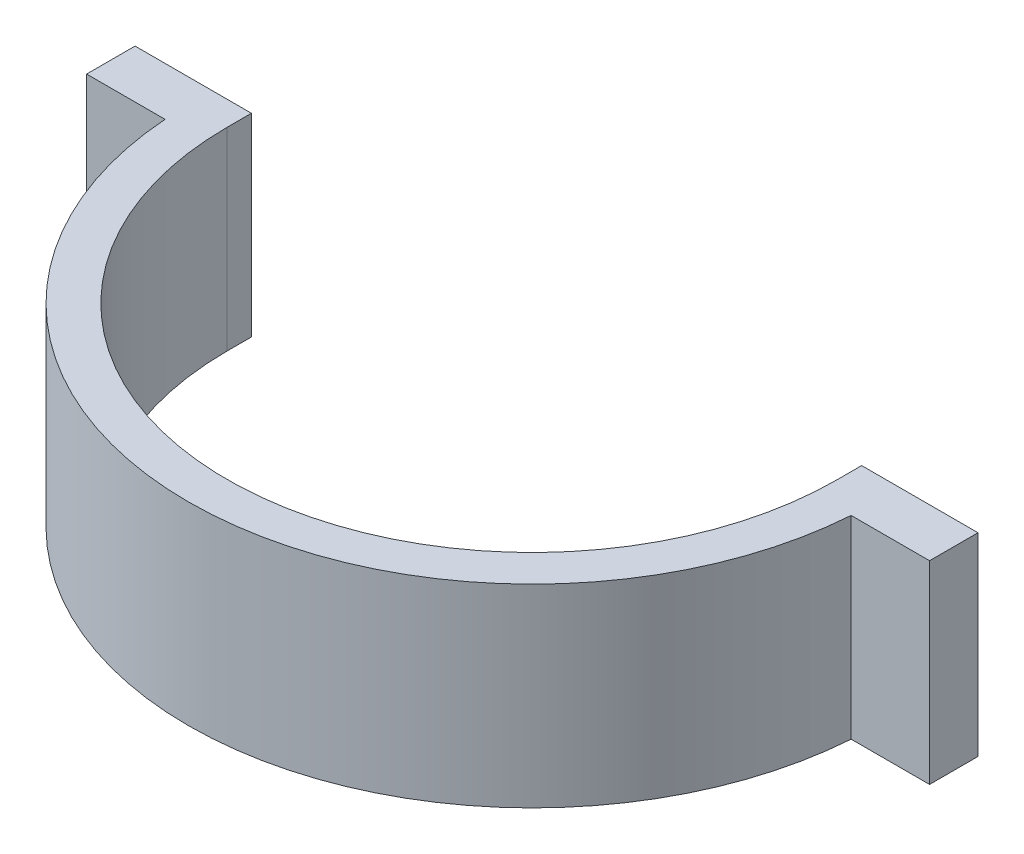
ISO-10303-21;
HEADER;
FILE_DESCRIPTION(('STEP AP214'),'2;1');
FILE_NAME('part.step','',(''),(''),'','','');
FILE_SCHEMA(('AUTOMOTIVE_DESIGN { 1 0 10303 214 1 1 1 1 }'));
ENDSEC;
DATA;
#1=APPLICATION_CONTEXT('core data for automotive mechanical design processes');
#2=APPLICATION_PROTOCOL_DEFINITION('international standard','automotive_design',2000,#1);
#3=PRODUCT_CONTEXT('',#1,'mechanical');
#4=PRODUCT('Part','Part','',(#3));
#5=PRODUCT_RELATED_PRODUCT_CATEGORY('part','',(#4));
#6=PRODUCT_DEFINITION_FORMATION('','',#4);
#7=PRODUCT_DEFINITION_CONTEXT('part definition',#1,'design');
#8=PRODUCT_DEFINITION('design','',#6,#7);
#9=PRODUCT_DEFINITION_SHAPE('','',#8);
#10=(LENGTH_UNIT() NAMED_UNIT(*) SI_UNIT(.MILLI.,.METRE.));
#11=(NAMED_UNIT(*) PLANE_ANGLE_UNIT() SI_UNIT($,.RADIAN.));
#12=(NAMED_UNIT(*) SI_UNIT($,.STERADIAN.) SOLID_ANGLE_UNIT());
#13=UNCERTAINTY_MEASURE_WITH_UNIT(LENGTH_MEASURE(1.E-05),#10,'distance_accuracy_value','');
#14=(GEOMETRIC_REPRESENTATION_CONTEXT(3) GLOBAL_UNCERTAINTY_ASSIGNED_CONTEXT((#13)) GLOBAL_UNIT_ASSIGNED_CONTEXT((#10,
#11,#12)) REPRESENTATION_CONTEXT('',''));
#15=CARTESIAN_POINT('',(0.,0.,0.));
#16=DIRECTION('',(0.,0.,1.));
#17=DIRECTION('',(1.,0.,0.));
#18=AXIS2_PLACEMENT_3D('',#15,#16,#17);
#19=CARTESIAN_POINT('',(0.,25.4,0.));
#20=DIRECTION('',(0.,-1.,0.));
#21=DIRECTION('',(0.,0.,-1.));
#22=AXIS2_PLACEMENT_3D('',#19,#20,#21);
#23=CYLINDRICAL_SURFACE('',#22,45.0723);
#24=DIRECTION('',(0.,-1.,0.));
#25=VECTOR('',#24,1.);
#26=CARTESIAN_POINT('',(-44.9603336541223,25.4,3.175));
#27=LINE('',#26,#25);
#28=CARTESIAN_POINT('',(-44.9603336541223,0.,3.175));
#29=VERTEX_POINT('',#28);
#30=CARTESIAN_POINT('',(-44.9603336541223,25.4,3.175));
#31=VERTEX_POINT('',#30);
#32=EDGE_CURVE('E137',#29,#31,#27,.F.);
#33=ORIENTED_EDGE('',*,*,#32,.F.);
#34=CARTESIAN_POINT('',(0.,0.,0.));
#35=DIRECTION('',(0.,1.,0.));
#36=DIRECTION('',(0.,0.,1.));
#37=AXIS2_PLACEMENT_3D('',#34,#35,#36);
#38=CIRCLE('',#37,45.0723);
#39=CARTESIAN_POINT('',(44.9603336541223,0.,3.175));
#40=VERTEX_POINT('',#39);
#41=EDGE_CURVE('E57',#29,#40,#38,.T.);
#42=ORIENTED_EDGE('',*,*,#41,.T.);
#43=DIRECTION('',(0.,-1.,0.));
#44=VECTOR('',#43,1.);
#45=CARTESIAN_POINT('',(44.9603336541223,25.4,3.175));
#46=LINE('',#45,#44);
#47=CARTESIAN_POINT('',(44.9603336541223,25.4,3.175));
#48=VERTEX_POINT('',#47);
#49=EDGE_CURVE('E11',#48,#40,#46,.T.);
#50=ORIENTED_EDGE('',*,*,#49,.F.);
#51=CARTESIAN_POINT('',(0.,25.4,0.));
#52=DIRECTION('',(0.,1.,0.));
#53=DIRECTION('',(0.,0.,1.));
#54=AXIS2_PLACEMENT_3D('',#51,#52,#53);
#55=CIRCLE('',#54,45.0723);
#56=EDGE_CURVE('E175',#31,#48,#55,.T.);
#57=ORIENTED_EDGE('',*,*,#56,.F.);
#58=EDGE_LOOP('',(#33,#42,#50,#57));
#59=FACE_BOUND('',#58,.T.);
#60=ADVANCED_FACE('F35',(#59),#23,.T.);
#61=CARTESIAN_POINT('',(0.,25.4,0.));
#62=DIRECTION('',(0.,1.,0.));
#63=DIRECTION('',(0.,0.,1.));
#64=AXIS2_PLACEMENT_3D('',#61,#62,#63);
#65=PLANE('',#64);
#66=DIRECTION('',(1.,0.,0.));
#67=VECTOR('',#66,1.);
#68=CARTESIAN_POINT('',(-45.0814156653053,25.4,3.175));
#69=LINE('',#68,#67);
#70=CARTESIAN_POINT('',(-55.2414156653053,25.4,3.175));
#71=VERTEX_POINT('',#70);
#72=EDGE_CURVE('E131',#71,#31,#69,.T.);
#73=ORIENTED_EDGE('',*,*,#72,.T.);
#74=ORIENTED_EDGE('',*,*,#56,.T.);
#75=DIRECTION('',(1.,0.,0.));
#76=VECTOR('',#75,1.);
#77=CARTESIAN_POINT('',(45.0814156653053,25.4,3.175));
#78=LINE('',#77,#76);
#79=CARTESIAN_POINT('',(55.2414156653053,25.4,3.175));
#80=VERTEX_POINT('',#79);
#81=EDGE_CURVE('E149',#48,#80,#78,.T.);
#82=ORIENTED_EDGE('',*,*,#81,.T.);
#83=DIRECTION('',(0.,0.,1.));
#84=VECTOR('',#83,1.);
#85=CARTESIAN_POINT('',(55.2414156653053,25.4,-3.175));
#86=LINE('',#85,#84);
#87=CARTESIAN_POINT('',(55.2414156653053,25.4,-3.175));
#88=VERTEX_POINT('',#87);
#89=EDGE_CURVE('E168',#88,#80,#86,.T.);
#90=ORIENTED_EDGE('',*,*,#89,.F.);
#91=DIRECTION('',(1.,0.,0.));
#92=VECTOR('',#91,1.);
#93=CARTESIAN_POINT('',(45.0814156653053,25.4,-3.175));
#94=LINE('',#93,#92);
#95=CARTESIAN_POINT('',(39.9923,25.4,-3.175));
#96=VERTEX_POINT('',#95);
#97=EDGE_CURVE('E145',#96,#88,#94,.T.);
#98=ORIENTED_EDGE('',*,*,#97,.F.);
#99=DIRECTION('',(0.,0.,1.));
#100=VECTOR('',#99,1.);
#101=CARTESIAN_POINT('',(39.9923,25.4,-3.175));
#102=LINE('',#101,#100);
#103=CARTESIAN_POINT('',(39.9923,25.4,0.));
#104=VERTEX_POINT('',#103);
#105=EDGE_CURVE('E49',#96,#104,#102,.T.);
#106=ORIENTED_EDGE('',*,*,#105,.T.);
#107=CARTESIAN_POINT('',(0.,25.4,0.));
#108=DIRECTION('',(0.,1.,0.));
#109=DIRECTION('',(0.,0.,1.));
#110=AXIS2_PLACEMENT_3D('',#107,#108,#109);
#111=CIRCLE('',#110,39.9923);
#112=CARTESIAN_POINT('',(-39.9923,25.4,0.));
#113=VERTEX_POINT('',#112);
#114=EDGE_CURVE('E136',#113,#104,#111,.T.);
#115=ORIENTED_EDGE('',*,*,#114,.F.);
#116=DIRECTION('',(0.,0.,1.));
#117=VECTOR('',#116,1.);
#118=CARTESIAN_POINT('',(-39.9923,25.4,-3.175));
#119=LINE('',#118,#117);
#120=CARTESIAN_POINT('',(-39.9923,25.4,-3.175));
#121=VERTEX_POINT('',#120);
#122=EDGE_CURVE('E116',#121,#113,#119,.T.);
#123=ORIENTED_EDGE('',*,*,#122,.F.);
#124=DIRECTION('',(1.,0.,0.));
#125=VECTOR('',#124,1.);
#126=CARTESIAN_POINT('',(-45.0814156653053,25.4,-3.175));
#127=LINE('',#126,#125);
#128=CARTESIAN_POINT('',(-55.2414156653053,25.4,-3.175));
#129=VERTEX_POINT('',#128);
#130=EDGE_CURVE('E123',#129,#121,#127,.T.);
#131=ORIENTED_EDGE('',*,*,#130,.F.);
#132=DIRECTION('',(0.,0.,1.));
#133=VECTOR('',#132,1.);
#134=CARTESIAN_POINT('',(-55.2414156653053,25.4,-3.175));
#135=LINE('',#134,#133);
#136=EDGE_CURVE('E209',#129,#71,#135,.T.);
#137=ORIENTED_EDGE('',*,*,#136,.T.);
#138=EDGE_LOOP('',(#73,#74,#82,#90,#98,#106,#115,#123,#131,#137));
#139=FACE_BOUND('',#138,.T.);
#140=ADVANCED_FACE('F134',(#139),#65,.T.);
#141=CARTESIAN_POINT('',(0.,0.,0.));
#142=DIRECTION('',(0.,1.,0.));
#143=DIRECTION('',(0.,0.,1.));
#144=AXIS2_PLACEMENT_3D('',#141,#142,#143);
#145=PLANE('',#144);
#146=ORIENTED_EDGE('',*,*,#41,.F.);
#147=DIRECTION('',(-1.,0.,0.));
#148=VECTOR('',#147,1.);
#149=CARTESIAN_POINT('',(-55.2414156653053,0.,3.175));
#150=LINE('',#149,#148);
#151=CARTESIAN_POINT('',(-55.2414156653053,0.,3.175));
#152=VERTEX_POINT('',#151);
#153=EDGE_CURVE('E201',#29,#152,#150,.T.);
#154=ORIENTED_EDGE('',*,*,#153,.T.);
#155=DIRECTION('',(0.,0.,1.));
#156=VECTOR('',#155,1.);
#157=CARTESIAN_POINT('',(-55.2414156653053,0.,-3.175));
#158=LINE('',#157,#156);
#159=CARTESIAN_POINT('',(-55.2414156653053,0.,-3.175));
#160=VERTEX_POINT('',#159);
#161=EDGE_CURVE('E141',#160,#152,#158,.T.);
#162=ORIENTED_EDGE('',*,*,#161,.F.);
#163=DIRECTION('',(-1.,0.,0.));
#164=VECTOR('',#163,1.);
#165=CARTESIAN_POINT('',(-45.1671960583249,0.,-3.175));
#166=LINE('',#165,#164);
#167=CARTESIAN_POINT('',(-39.9923,0.,-3.175));
#168=VERTEX_POINT('',#167);
#169=EDGE_CURVE('E122',#168,#160,#166,.T.);
#170=ORIENTED_EDGE('',*,*,#169,.F.);
#171=DIRECTION('',(0.,0.,1.));
#172=VECTOR('',#171,1.);
#173=CARTESIAN_POINT('',(-39.9923,0.,-3.175));
#174=LINE('',#173,#172);
#175=CARTESIAN_POINT('',(-39.9923,0.,0.));
#176=VERTEX_POINT('',#175);
#177=EDGE_CURVE('E119',#168,#176,#174,.T.);
#178=ORIENTED_EDGE('',*,*,#177,.T.);
#179=CARTESIAN_POINT('',(0.,0.,0.));
#180=DIRECTION('',(0.,1.,0.));
#181=DIRECTION('',(0.,0.,1.));
#182=AXIS2_PLACEMENT_3D('',#179,#180,#181);
#183=CIRCLE('',#182,39.9923);
#184=CARTESIAN_POINT('',(39.9923,0.,0.));
#185=VERTEX_POINT('',#184);
#186=EDGE_CURVE('E171',#176,#185,#183,.T.);
#187=ORIENTED_EDGE('',*,*,#186,.T.);
#188=DIRECTION('',(0.,0.,1.));
#189=VECTOR('',#188,1.);
#190=CARTESIAN_POINT('',(39.9923,0.,-3.175));
#191=LINE('',#190,#189);
#192=CARTESIAN_POINT('',(39.9923,0.,-3.175));
#193=VERTEX_POINT('',#192);
#194=EDGE_CURVE('E163',#193,#185,#191,.T.);
#195=ORIENTED_EDGE('',*,*,#194,.F.);
#196=DIRECTION('',(-1.,0.,0.));
#197=VECTOR('',#196,1.);
#198=CARTESIAN_POINT('',(55.2414156653053,0.,-3.175));
#199=LINE('',#198,#197);
#200=CARTESIAN_POINT('',(55.2414156653053,0.,-3.175));
#201=VERTEX_POINT('',#200);
#202=EDGE_CURVE('E151',#201,#193,#199,.T.);
#203=ORIENTED_EDGE('',*,*,#202,.F.);
#204=DIRECTION('',(0.,0.,1.));
#205=VECTOR('',#204,1.);
#206=CARTESIAN_POINT('',(55.2414156653053,0.,-3.175));
#207=LINE('',#206,#205);
#208=CARTESIAN_POINT('',(55.2414156653053,0.,3.175));
#209=VERTEX_POINT('',#208);
#210=EDGE_CURVE('E165',#201,#209,#207,.T.);
#211=ORIENTED_EDGE('',*,*,#210,.T.);
#212=DIRECTION('',(-1.,0.,0.));
#213=VECTOR('',#212,1.);
#214=CARTESIAN_POINT('',(45.1671960583249,0.,3.175));
#215=LINE('',#214,#213);
#216=EDGE_CURVE('E158',#209,#40,#215,.T.);
#217=ORIENTED_EDGE('',*,*,#216,.T.);
#218=EDGE_LOOP('',(#146,#154,#162,#170,#178,#187,#195,#203,#211,#217));
#219=FACE_BOUND('',#218,.T.);
#220=ADVANCED_FACE('F182',(#219),#145,.F.);
#221=CARTESIAN_POINT('',(0.,25.4,0.));
#222=DIRECTION('',(0.,-1.,0.));
#223=DIRECTION('',(0.,0.,-1.));
#224=AXIS2_PLACEMENT_3D('',#221,#222,#223);
#225=CYLINDRICAL_SURFACE('',#224,39.9923);
#226=DIRECTION('',(0.,-1.,0.));
#227=VECTOR('',#226,1.);
#228=CARTESIAN_POINT('',(-39.9923,25.4,0.));
#229=LINE('',#228,#227);
#230=EDGE_CURVE('E42',#113,#176,#229,.T.);
#231=ORIENTED_EDGE('',*,*,#230,.F.);
#232=ORIENTED_EDGE('',*,*,#114,.T.);
#233=DIRECTION('',(0.,-1.,0.));
#234=VECTOR('',#233,1.);
#235=CARTESIAN_POINT('',(39.9923,25.4,0.));
#236=LINE('',#235,#234);
#237=EDGE_CURVE('E177',#185,#104,#236,.F.);
#238=ORIENTED_EDGE('',*,*,#237,.F.);
#239=ORIENTED_EDGE('',*,*,#186,.F.);
#240=EDGE_LOOP('',(#231,#232,#238,#239));
#241=FACE_BOUND('',#240,.T.);
#242=ADVANCED_FACE('F186',(#241),#225,.F.);
#243=CARTESIAN_POINT('',(0.,0.,3.175));
#244=DIRECTION('',(0.,0.,-1.));
#245=DIRECTION('',(-1.,0.,0.));
#246=AXIS2_PLACEMENT_3D('',#243,#244,#245);
#247=PLANE('',#246);
#248=ORIENTED_EDGE('',*,*,#81,.F.);
#249=ORIENTED_EDGE('',*,*,#49,.T.);
#250=ORIENTED_EDGE('',*,*,#216,.F.);
#251=DIRECTION('',(0.,-1.,0.));
#252=VECTOR('',#251,1.);
#253=CARTESIAN_POINT('',(55.2414156653053,25.4,3.175));
#254=LINE('',#253,#252);
#255=EDGE_CURVE('E139',#80,#209,#254,.T.);
#256=ORIENTED_EDGE('',*,*,#255,.F.);
#257=EDGE_LOOP('',(#248,#249,#250,#256));
#258=FACE_BOUND('',#257,.T.);
#259=ADVANCED_FACE('F200',(#258),#247,.F.);
#260=CARTESIAN_POINT('',(39.9923,25.4,-3.175));
#261=DIRECTION('',(1.,0.,0.));
#262=DIRECTION('',(0.,1.,0.));
#263=AXIS2_PLACEMENT_3D('',#260,#261,#262);
#264=PLANE('',#263);
#265=ORIENTED_EDGE('',*,*,#194,.T.);
#266=ORIENTED_EDGE('',*,*,#237,.T.);
#267=ORIENTED_EDGE('',*,*,#105,.F.);
#268=DIRECTION('',(0.,1.,0.));
#269=VECTOR('',#268,1.);
#270=CARTESIAN_POINT('',(39.9923,25.4,-3.175));
#271=LINE('',#270,#269);
#272=EDGE_CURVE('E153',#193,#96,#271,.T.);
#273=ORIENTED_EDGE('',*,*,#272,.F.);
#274=EDGE_LOOP('',(#265,#266,#267,#273));
#275=FACE_BOUND('',#274,.T.);
#276=ADVANCED_FACE('F188',(#275),#264,.F.);
#277=CARTESIAN_POINT('',(55.2414156653053,25.4,-3.175));
#278=DIRECTION('',(-1.,0.,0.));
#279=DIRECTION('',(0.,0.,1.));
#280=AXIS2_PLACEMENT_3D('',#277,#278,#279);
#281=PLANE('',#280);
#282=ORIENTED_EDGE('',*,*,#255,.T.);
#283=ORIENTED_EDGE('',*,*,#210,.F.);
#284=DIRECTION('',(0.,-1.,0.));
#285=VECTOR('',#284,1.);
#286=CARTESIAN_POINT('',(55.2414156653053,25.4,-3.175));
#287=LINE('',#286,#285);
#288=EDGE_CURVE('E148',#88,#201,#287,.T.);
#289=ORIENTED_EDGE('',*,*,#288,.F.);
#290=ORIENTED_EDGE('',*,*,#89,.T.);
#291=EDGE_LOOP('',(#282,#283,#289,#290));
#292=FACE_BOUND('',#291,.T.);
#293=ADVANCED_FACE('F196',(#292),#281,.F.);
#294=CARTESIAN_POINT('',(0.,0.,-3.175));
#295=DIRECTION('',(0.,0.,-1.));
#296=DIRECTION('',(-1.,0.,0.));
#297=AXIS2_PLACEMENT_3D('',#294,#295,#296);
#298=PLANE('',#297);
#299=ORIENTED_EDGE('',*,*,#97,.T.);
#300=ORIENTED_EDGE('',*,*,#288,.T.);
#301=ORIENTED_EDGE('',*,*,#202,.T.);
#302=ORIENTED_EDGE('',*,*,#272,.T.);
#303=EDGE_LOOP('',(#299,#300,#301,#302));
#304=FACE_BOUND('',#303,.T.);
#305=ADVANCED_FACE('F193',(#304),#298,.T.);
#306=CARTESIAN_POINT('',(0.,0.,3.175));
#307=DIRECTION('',(0.,0.,-1.));
#308=DIRECTION('',(-1.,0.,0.));
#309=AXIS2_PLACEMENT_3D('',#306,#307,#308);
#310=PLANE('',#309);
#311=ORIENTED_EDGE('',*,*,#153,.F.);
#312=ORIENTED_EDGE('',*,*,#32,.T.);
#313=ORIENTED_EDGE('',*,*,#72,.F.);
#314=DIRECTION('',(0.,1.,0.));
#315=VECTOR('',#314,1.);
#316=CARTESIAN_POINT('',(-55.2414156653053,25.4,3.175));
#317=LINE('',#316,#315);
#318=EDGE_CURVE('E205',#152,#71,#317,.T.);
#319=ORIENTED_EDGE('',*,*,#318,.F.);
#320=EDGE_LOOP('',(#311,#312,#313,#319));
#321=FACE_BOUND('',#320,.T.);
#322=ADVANCED_FACE('F211',(#321),#310,.F.);
#323=CARTESIAN_POINT('',(-39.9923,25.4,-3.175));
#324=DIRECTION('',(-1.,0.,0.));
#325=DIRECTION('',(0.,-1.,0.));
#326=AXIS2_PLACEMENT_3D('',#323,#324,#325);
#327=PLANE('',#326);
#328=ORIENTED_EDGE('',*,*,#122,.T.);
#329=ORIENTED_EDGE('',*,*,#230,.T.);
#330=ORIENTED_EDGE('',*,*,#177,.F.);
#331=DIRECTION('',(0.,-1.,0.));
#332=VECTOR('',#331,1.);
#333=CARTESIAN_POINT('',(-39.9923,25.4,-3.175));
#334=LINE('',#333,#332);
#335=EDGE_CURVE('E112',#121,#168,#334,.T.);
#336=ORIENTED_EDGE('',*,*,#335,.F.);
#337=EDGE_LOOP('',(#328,#329,#330,#336));
#338=FACE_BOUND('',#337,.T.);
#339=ADVANCED_FACE('F114',(#338),#327,.F.);
#340=CARTESIAN_POINT('',(-55.2414156653053,25.4,-3.175));
#341=DIRECTION('',(1.,0.,0.));
#342=DIRECTION('',(0.,0.,-1.));
#343=AXIS2_PLACEMENT_3D('',#340,#341,#342);
#344=PLANE('',#343);
#345=ORIENTED_EDGE('',*,*,#318,.T.);
#346=ORIENTED_EDGE('',*,*,#136,.F.);
#347=DIRECTION('',(0.,1.,0.));
#348=VECTOR('',#347,1.);
#349=CARTESIAN_POINT('',(-55.2414156653053,25.4,-3.175));
#350=LINE('',#349,#348);
#351=EDGE_CURVE('E128',#160,#129,#350,.T.);
#352=ORIENTED_EDGE('',*,*,#351,.F.);
#353=ORIENTED_EDGE('',*,*,#161,.T.);
#354=EDGE_LOOP('',(#345,#346,#352,#353));
#355=FACE_BOUND('',#354,.T.);
#356=ADVANCED_FACE('F208',(#355),#344,.F.);
#357=CARTESIAN_POINT('',(0.,0.,-3.175));
#358=DIRECTION('',(0.,0.,-1.));
#359=DIRECTION('',(-1.,0.,0.));
#360=AXIS2_PLACEMENT_3D('',#357,#358,#359);
#361=PLANE('',#360);
#362=ORIENTED_EDGE('',*,*,#130,.T.);
#363=ORIENTED_EDGE('',*,*,#335,.T.);
#364=ORIENTED_EDGE('',*,*,#169,.T.);
#365=ORIENTED_EDGE('',*,*,#351,.T.);
#366=EDGE_LOOP('',(#362,#363,#364,#365));
#367=FACE_BOUND('',#366,.T.);
#368=ADVANCED_FACE('F126',(#367),#361,.T.);
#369=CLOSED_SHELL('',(#60,#140,#220,#242,#259,#276,#293,#305,#322,#339,#356,#368));
#370=MANIFOLD_SOLID_BREP('B2',#369);
#371=ADVANCED_BREP_SHAPE_REPRESENTATION('',(#18,#370),#14);
#372=SHAPE_DEFINITION_REPRESENTATION(#9,#371);
ENDSEC;
END-ISO-10303-21;
